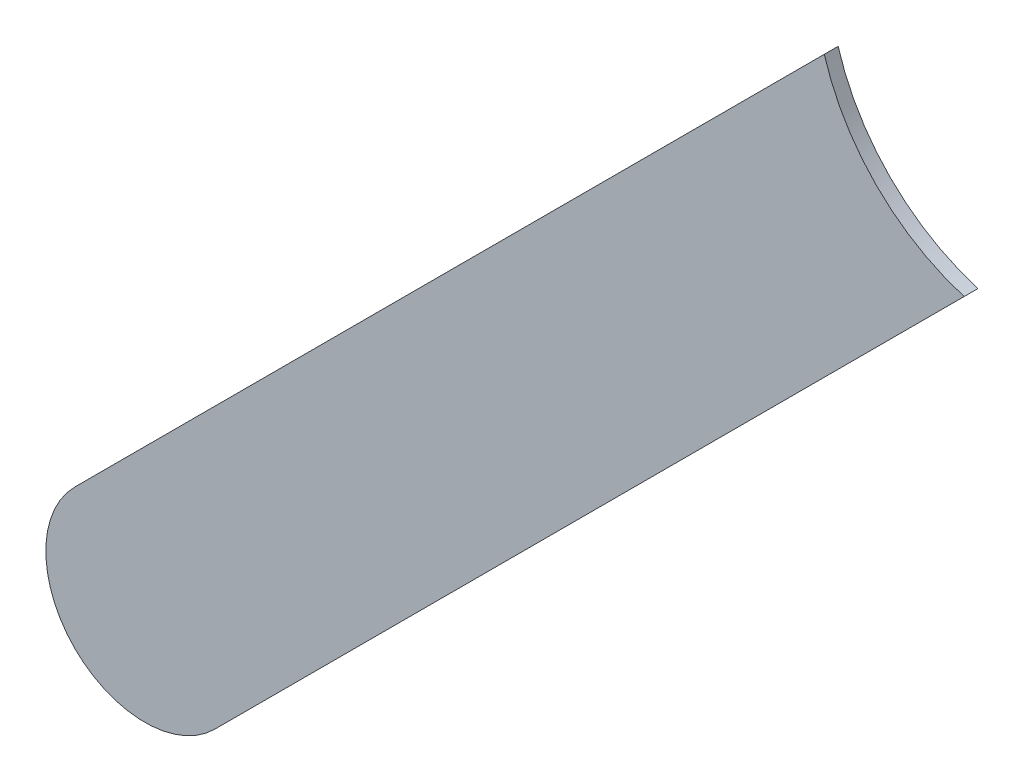
ISO-10303-21;
HEADER;
FILE_DESCRIPTION(('STEP AP214'),'2;1');
FILE_NAME('part.step','',(''),(''),'','','');
FILE_SCHEMA(('AUTOMOTIVE_DESIGN { 1 0 10303 214 1 1 1 1 }'));
ENDSEC;
DATA;
#1=APPLICATION_CONTEXT('core data for automotive mechanical design processes');
#2=APPLICATION_PROTOCOL_DEFINITION('international standard','automotive_design',2000,#1);
#3=PRODUCT_CONTEXT('',#1,'mechanical');
#4=PRODUCT('Part','Part','',(#3));
#5=PRODUCT_RELATED_PRODUCT_CATEGORY('part','',(#4));
#6=PRODUCT_DEFINITION_FORMATION('','',#4);
#7=PRODUCT_DEFINITION_CONTEXT('part definition',#1,'design');
#8=PRODUCT_DEFINITION('design','',#6,#7);
#9=PRODUCT_DEFINITION_SHAPE('','',#8);
#10=(LENGTH_UNIT() NAMED_UNIT(*) SI_UNIT(.MILLI.,.METRE.));
#11=(NAMED_UNIT(*) PLANE_ANGLE_UNIT() SI_UNIT($,.RADIAN.));
#12=(NAMED_UNIT(*) SI_UNIT($,.STERADIAN.) SOLID_ANGLE_UNIT());
#13=UNCERTAINTY_MEASURE_WITH_UNIT(LENGTH_MEASURE(1.E-05),#10,'distance_accuracy_value','');
#14=(GEOMETRIC_REPRESENTATION_CONTEXT(3) GLOBAL_UNCERTAINTY_ASSIGNED_CONTEXT((#13)) GLOBAL_UNIT_ASSIGNED_CONTEXT((#10,
#11,#12)) REPRESENTATION_CONTEXT('',''));
#15=CARTESIAN_POINT('',(0.,0.,0.));
#16=DIRECTION('',(0.,0.,1.));
#17=DIRECTION('',(1.,0.,0.));
#18=AXIS2_PLACEMENT_3D('',#15,#16,#17);
#19=CARTESIAN_POINT('',(142.157776,-116.381776,-0.035));
#20=DIRECTION('',(-0.707106781186548,0.707106781186548,0.));
#21=DIRECTION('',(0.,0.,1.));
#22=AXIS2_PLACEMENT_3D('',#19,#20,#21);
#23=PLANE('',#22);
#24=DIRECTION('',(0.,0.,-1.));
#25=VECTOR('',#24,1.);
#26=CARTESIAN_POINT('',(144.05233650204,-114.4872154979,-0.045));
#27=LINE('',#26,#25);
#28=CARTESIAN_POINT('',(144.05233650205,-114.4872154979,0.));
#29=VERTEX_POINT('',#28);
#30=CARTESIAN_POINT('',(144.05233650205,-114.4872154979,-0.035));
#31=VERTEX_POINT('',#30);
#32=EDGE_CURVE('E11',#29,#31,#27,.T.);
#33=ORIENTED_EDGE('',*,*,#32,.F.);
#34=DIRECTION('',(0.707106781186548,0.707106781186548,0.));
#35=VECTOR('',#34,1.);
#36=CARTESIAN_POINT('',(142.157776,-116.381776,0.));
#37=LINE('',#36,#35);
#38=CARTESIAN_POINT('',(142.157776,-116.381776,0.));
#39=VERTEX_POINT('',#38);
#40=EDGE_CURVE('E20',#39,#29,#37,.T.);
#41=ORIENTED_EDGE('',*,*,#40,.F.);
#42=DIRECTION('',(0.,0.,1.));
#43=VECTOR('',#42,1.);
#44=CARTESIAN_POINT('',(142.157776,-116.381776,-0.035));
#45=LINE('',#44,#43);
#46=CARTESIAN_POINT('',(142.157776,-116.381776,-0.035));
#47=VERTEX_POINT('',#46);
#48=EDGE_CURVE('E65',#47,#39,#45,.T.);
#49=ORIENTED_EDGE('',*,*,#48,.F.);
#50=DIRECTION('',(0.707106781186548,0.707106781186548,0.));
#51=VECTOR('',#50,1.);
#52=CARTESIAN_POINT('',(142.157776,-116.381776,-0.035));
#53=LINE('',#52,#51);
#54=EDGE_CURVE('E68',#47,#31,#53,.T.);
#55=ORIENTED_EDGE('',*,*,#54,.T.);
#56=EDGE_LOOP('',(#33,#41,#49,#55));
#57=FACE_BOUND('',#56,.T.);
#58=ADVANCED_FACE('F17',(#57),#23,.F.);
#59=CARTESIAN_POINT('',(144.202,-113.984,-0.045));
#60=DIRECTION('',(0.,0.,-1.));
#61=DIRECTION('',(0.,-1.,0.));
#62=AXIS2_PLACEMENT_3D('',#59,#60,#61);
#63=CYLINDRICAL_SURFACE('',#62,0.525);
#64=DIRECTION('',(0.,0.,-1.));
#65=VECTOR('',#64,1.);
#66=CARTESIAN_POINT('',(143.69878404357,-114.1336619564,-0.045));
#67=LINE('',#66,#65);
#68=CARTESIAN_POINT('',(143.69878404357,-114.1336619564,0.));
#69=VERTEX_POINT('',#68);
#70=CARTESIAN_POINT('',(143.69878404357,-114.1336619564,-0.035));
#71=VERTEX_POINT('',#70);
#72=EDGE_CURVE('E93',#69,#71,#67,.T.);
#73=ORIENTED_EDGE('',*,*,#72,.F.);
#74=CARTESIAN_POINT('',(144.202,-113.984,0.));
#75=DIRECTION('',(0.,0.,-1.));
#76=DIRECTION('',(0.,-1.,0.));
#77=AXIS2_PLACEMENT_3D('',#74,#75,#76);
#78=CIRCLE('',#77,0.525);
#79=EDGE_CURVE('E105',#29,#69,#78,.T.);
#80=ORIENTED_EDGE('',*,*,#79,.F.);
#81=ORIENTED_EDGE('',*,*,#32,.T.);
#82=CARTESIAN_POINT('',(144.202,-113.984,-0.035));
#83=DIRECTION('',(0.,0.,-1.));
#84=DIRECTION('',(0.,-1.,0.));
#85=AXIS2_PLACEMENT_3D('',#82,#83,#84);
#86=CIRCLE('',#85,0.525);
#87=EDGE_CURVE('E72',#31,#71,#86,.T.);
#88=ORIENTED_EDGE('',*,*,#87,.T.);
#89=EDGE_LOOP('',(#73,#80,#81,#88));
#90=FACE_BOUND('',#89,.T.);
#91=ADVANCED_FACE('F128',(#90),#63,.F.);
#92=CARTESIAN_POINT('',(144.025223,-113.807223,0.));
#93=DIRECTION('',(0.,0.,1.));
#94=DIRECTION('',(1.,0.,0.));
#95=AXIS2_PLACEMENT_3D('',#92,#93,#94);
#96=PLANE('',#95);
#97=ORIENTED_EDGE('',*,*,#79,.T.);
#98=DIRECTION('',(-0.707106781186548,-0.707106781186548,0.));
#99=VECTOR('',#98,1.);
#100=CARTESIAN_POINT('',(144.025223,-113.807223,0.));
#101=LINE('',#100,#99);
#102=CARTESIAN_POINT('',(141.804223,-116.028223,0.));
#103=VERTEX_POINT('',#102);
#104=EDGE_CURVE('E97',#69,#103,#101,.T.);
#105=ORIENTED_EDGE('',*,*,#104,.T.);
#106=CARTESIAN_POINT('',(141.9809995,-116.2049995,0.));
#107=DIRECTION('',(0.,0.,1.));
#108=DIRECTION('',(-0.707106781186548,0.707106781186548,0.));
#109=AXIS2_PLACEMENT_3D('',#106,#107,#108);
#110=CIRCLE('',#109,0.249999723809);
#111=EDGE_CURVE('E71',#103,#39,#110,.T.);
#112=ORIENTED_EDGE('',*,*,#111,.T.);
#113=ORIENTED_EDGE('',*,*,#40,.T.);
#114=EDGE_LOOP('',(#97,#105,#112,#113));
#115=FACE_BOUND('',#114,.T.);
#116=ADVANCED_FACE('F125',(#115),#96,.T.);
#117=CARTESIAN_POINT('',(141.9809995,-116.2049995,-0.035));
#118=DIRECTION('',(0.,0.,-1.));
#119=DIRECTION('',(-0.707106781186548,0.707106781186548,0.));
#120=AXIS2_PLACEMENT_3D('',#117,#118,#119);
#121=CYLINDRICAL_SURFACE('',#120,0.249999723809);
#122=CARTESIAN_POINT('',(141.9809995,-116.2049995,-0.035));
#123=DIRECTION('',(0.,0.,1.));
#124=DIRECTION('',(-0.707106781186548,0.707106781186548,0.));
#125=AXIS2_PLACEMENT_3D('',#122,#123,#124);
#126=CIRCLE('',#125,0.249999723809);
#127=CARTESIAN_POINT('',(141.804223,-116.028223,-0.035));
#128=VERTEX_POINT('',#127);
#129=EDGE_CURVE('E75',#128,#47,#126,.T.);
#130=ORIENTED_EDGE('',*,*,#129,.T.);
#131=ORIENTED_EDGE('',*,*,#48,.T.);
#132=ORIENTED_EDGE('',*,*,#111,.F.);
#133=DIRECTION('',(0.,0.,1.));
#134=VECTOR('',#133,1.);
#135=CARTESIAN_POINT('',(141.804223,-116.028223,-0.035));
#136=LINE('',#135,#134);
#137=EDGE_CURVE('E78',#128,#103,#136,.T.);
#138=ORIENTED_EDGE('',*,*,#137,.F.);
#139=EDGE_LOOP('',(#130,#131,#132,#138));
#140=FACE_BOUND('',#139,.T.);
#141=ADVANCED_FACE('F76',(#140),#121,.T.);
#142=CARTESIAN_POINT('',(144.025223,-113.807223,-0.035));
#143=DIRECTION('',(0.,0.,1.));
#144=DIRECTION('',(1.,0.,0.));
#145=AXIS2_PLACEMENT_3D('',#142,#143,#144);
#146=PLANE('',#145);
#147=ORIENTED_EDGE('',*,*,#54,.F.);
#148=ORIENTED_EDGE('',*,*,#129,.F.);
#149=DIRECTION('',(-0.707106781186548,-0.707106781186548,0.));
#150=VECTOR('',#149,1.);
#151=CARTESIAN_POINT('',(144.025223,-113.807223,-0.035));
#152=LINE('',#151,#150);
#153=EDGE_CURVE('E87',#71,#128,#152,.T.);
#154=ORIENTED_EDGE('',*,*,#153,.F.);
#155=ORIENTED_EDGE('',*,*,#87,.F.);
#156=EDGE_LOOP('',(#147,#148,#154,#155));
#157=FACE_BOUND('',#156,.T.);
#158=ADVANCED_FACE('F85',(#157),#146,.F.);
#159=CARTESIAN_POINT('',(144.025223,-113.807223,-0.035));
#160=DIRECTION('',(0.707106781186548,-0.707106781186548,0.));
#161=DIRECTION('',(0.,0.,-1.));
#162=AXIS2_PLACEMENT_3D('',#159,#160,#161);
#163=PLANE('',#162);
#164=ORIENTED_EDGE('',*,*,#137,.T.);
#165=ORIENTED_EDGE('',*,*,#104,.F.);
#166=ORIENTED_EDGE('',*,*,#72,.T.);
#167=ORIENTED_EDGE('',*,*,#153,.T.);
#168=EDGE_LOOP('',(#164,#165,#166,#167));
#169=FACE_BOUND('',#168,.T.);
#170=ADVANCED_FACE('F126',(#169),#163,.F.);
#171=CLOSED_SHELL('',(#58,#91,#116,#141,#158,#170));
#172=MANIFOLD_SOLID_BREP('B1',#171);
#173=ADVANCED_BREP_SHAPE_REPRESENTATION('',(#18,#172),#14);
#174=SHAPE_DEFINITION_REPRESENTATION(#9,#173);
ENDSEC;
END-ISO-10303-21;
